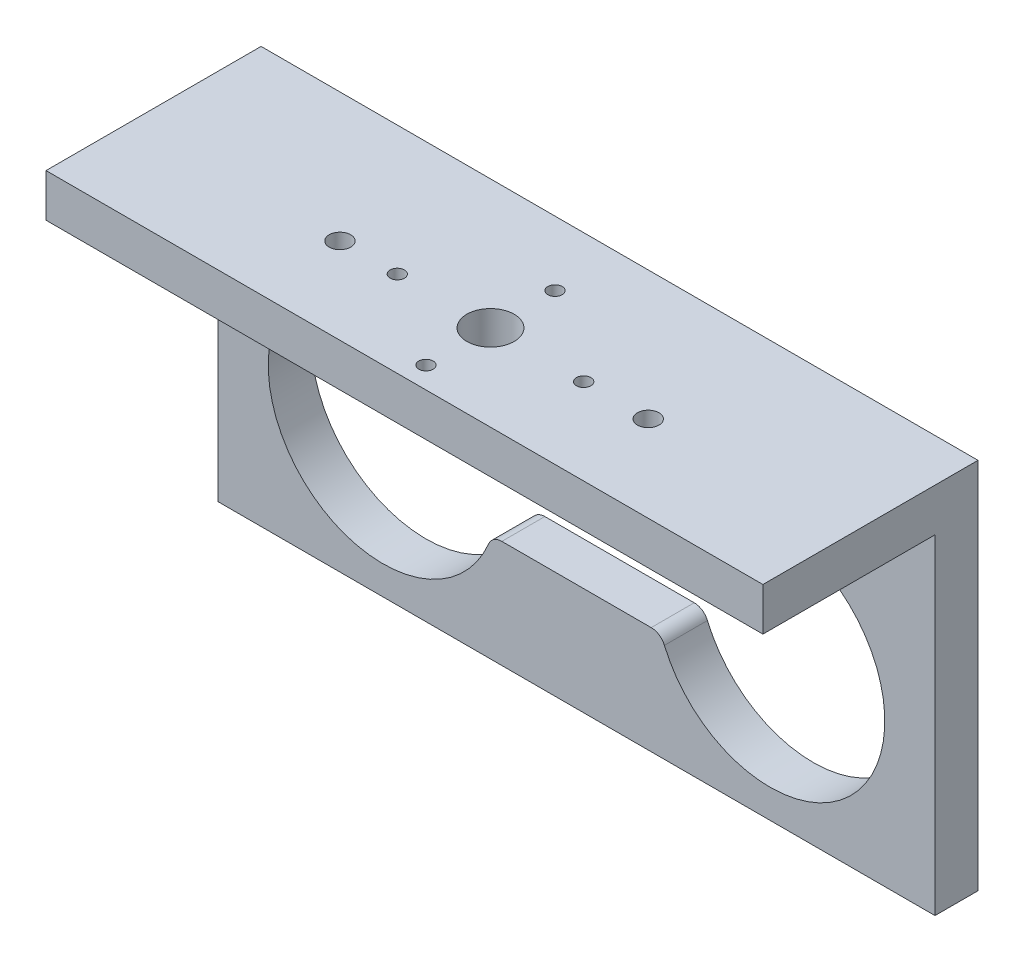
ISO-10303-21;
HEADER;
FILE_DESCRIPTION(('STEP AP214'),'2;1');
FILE_NAME('part.step','',(''),(''),'','','');
FILE_SCHEMA(('AUTOMOTIVE_DESIGN { 1 0 10303 214 1 1 1 1 }'));
ENDSEC;
DATA;
#1=APPLICATION_CONTEXT('core data for automotive mechanical design processes');
#2=APPLICATION_PROTOCOL_DEFINITION('international standard','automotive_design',2000,#1);
#3=PRODUCT_CONTEXT('',#1,'mechanical');
#4=PRODUCT('Part','Part','',(#3));
#5=PRODUCT_RELATED_PRODUCT_CATEGORY('part','',(#4));
#6=PRODUCT_DEFINITION_FORMATION('','',#4);
#7=PRODUCT_DEFINITION_CONTEXT('part definition',#1,'design');
#8=PRODUCT_DEFINITION('design','',#6,#7);
#9=PRODUCT_DEFINITION_SHAPE('','',#8);
#10=(LENGTH_UNIT() NAMED_UNIT(*) SI_UNIT(.MILLI.,.METRE.));
#11=(NAMED_UNIT(*) PLANE_ANGLE_UNIT() SI_UNIT($,.RADIAN.));
#12=(NAMED_UNIT(*) SI_UNIT($,.STERADIAN.) SOLID_ANGLE_UNIT());
#13=UNCERTAINTY_MEASURE_WITH_UNIT(LENGTH_MEASURE(1.E-05),#10,'distance_accuracy_value','');
#14=(GEOMETRIC_REPRESENTATION_CONTEXT(3) GLOBAL_UNCERTAINTY_ASSIGNED_CONTEXT((#13)) GLOBAL_UNIT_ASSIGNED_CONTEXT((#10,
#11,#12)) REPRESENTATION_CONTEXT('',''));
#15=CARTESIAN_POINT('',(0.,0.,0.));
#16=DIRECTION('',(0.,0.,1.));
#17=DIRECTION('',(1.,0.,0.));
#18=AXIS2_PLACEMENT_3D('',#15,#16,#17);
#19=CARTESIAN_POINT('',(-25.,16.,15.));
#20=DIRECTION('',(0.,0.,-1.));
#21=DIRECTION('',(-1.,0.,0.));
#22=AXIS2_PLACEMENT_3D('',#19,#20,#21);
#23=PLANE('',#22);
#24=DIRECTION('',(-1.,0.,0.));
#25=VECTOR('',#24,1.);
#26=CARTESIAN_POINT('',(25.,13.,15.));
#27=LINE('',#26,#25);
#28=CARTESIAN_POINT('',(25.,13.,15.));
#29=VERTEX_POINT('',#28);
#30=CARTESIAN_POINT('',(-25.,13.,15.));
#31=VERTEX_POINT('',#30);
#32=EDGE_CURVE('E168',#29,#31,#27,.T.);
#33=ORIENTED_EDGE('',*,*,#32,.F.);
#34=DIRECTION('',(0.,-1.,0.));
#35=VECTOR('',#34,1.);
#36=CARTESIAN_POINT('',(25.,16.,15.));
#37=LINE('',#36,#35);
#38=CARTESIAN_POINT('',(25.,16.,15.));
#39=VERTEX_POINT('',#38);
#40=EDGE_CURVE('E180',#39,#29,#37,.T.);
#41=ORIENTED_EDGE('',*,*,#40,.F.);
#42=DIRECTION('',(1.,0.,0.));
#43=VECTOR('',#42,1.);
#44=CARTESIAN_POINT('',(-25.,16.,15.));
#45=LINE('',#44,#43);
#46=CARTESIAN_POINT('',(-25.,16.,15.));
#47=VERTEX_POINT('',#46);
#48=EDGE_CURVE('E308',#47,#39,#45,.T.);
#49=ORIENTED_EDGE('',*,*,#48,.F.);
#50=DIRECTION('',(0.,-1.,0.));
#51=VECTOR('',#50,1.);
#52=CARTESIAN_POINT('',(-25.,16.,15.));
#53=LINE('',#52,#51);
#54=EDGE_CURVE('E183',#47,#31,#53,.T.);
#55=ORIENTED_EDGE('',*,*,#54,.T.);
#56=EDGE_LOOP('',(#33,#41,#49,#55));
#57=FACE_BOUND('',#56,.T.);
#58=ADVANCED_FACE('F37',(#57),#23,.F.);
#59=CARTESIAN_POINT('',(0.,0.,3.));
#60=DIRECTION('',(0.,0.,1.));
#61=DIRECTION('',(1.,0.,0.));
#62=AXIS2_PLACEMENT_3D('',#59,#60,#61);
#63=PLANE('',#62);
#64=DIRECTION('',(0.,-1.,0.));
#65=VECTOR('',#64,1.);
#66=CARTESIAN_POINT('',(-25.,-10.,3.));
#67=LINE('',#66,#65);
#68=CARTESIAN_POINT('',(-25.,13.,3.));
#69=VERTEX_POINT('',#68);
#70=CARTESIAN_POINT('',(-25.,-10.,3.));
#71=VERTEX_POINT('',#70);
#72=EDGE_CURVE('E281',#69,#71,#67,.T.);
#73=ORIENTED_EDGE('',*,*,#72,.T.);
#74=DIRECTION('',(1.,0.,0.));
#75=VECTOR('',#74,1.);
#76=CARTESIAN_POINT('',(25.,-10.,3.));
#77=LINE('',#76,#75);
#78=CARTESIAN_POINT('',(25.,-10.,3.));
#79=VERTEX_POINT('',#78);
#80=EDGE_CURVE('E284',#71,#79,#77,.T.);
#81=ORIENTED_EDGE('',*,*,#80,.T.);
#82=DIRECTION('',(0.,1.,0.));
#83=VECTOR('',#82,1.);
#84=CARTESIAN_POINT('',(25.,-10.,3.));
#85=LINE('',#84,#83);
#86=CARTESIAN_POINT('',(25.,13.,3.));
#87=VERTEX_POINT('',#86);
#88=EDGE_CURVE('E287',#79,#87,#85,.T.);
#89=ORIENTED_EDGE('',*,*,#88,.T.);
#90=DIRECTION('',(1.,0.,0.));
#91=VECTOR('',#90,1.);
#92=CARTESIAN_POINT('',(25.,13.,3.));
#93=LINE('',#92,#91);
#94=EDGE_CURVE('E171',#69,#87,#93,.T.);
#95=ORIENTED_EDGE('',*,*,#94,.F.);
#96=EDGE_LOOP('',(#73,#81,#89,#95));
#97=FACE_BOUND('',#96,.T.);
#98=CARTESIAN_POINT('',(13.5,0.,3.));
#99=DIRECTION('',(0.,0.,1.));
#100=DIRECTION('',(1.,0.,0.));
#101=AXIS2_PLACEMENT_3D('',#98,#99,#100);
#102=CIRCLE('',#101,8.);
#103=CARTESIAN_POINT('',(6.12972268809911,-3.11111111111111,3.));
#104=VERTEX_POINT('',#103);
#105=CARTESIAN_POINT('',(6.12972268809911,3.11111111111111,3.));
#106=VERTEX_POINT('',#105);
#107=EDGE_CURVE('E224',#104,#106,#102,.T.);
#108=ORIENTED_EDGE('',*,*,#107,.F.);
#109=CARTESIAN_POINT('',(5.2084380241115,-3.5,3.));
#110=DIRECTION('',(0.,0.,-1.));
#111=DIRECTION('',(-1.,0.,0.));
#112=AXIS2_PLACEMENT_3D('',#109,#110,#111);
#113=CIRCLE('',#112,1.);
#114=CARTESIAN_POINT('',(5.2084380241115,-2.5,3.));
#115=VERTEX_POINT('',#114);
#116=EDGE_CURVE('E222',#115,#104,#113,.T.);
#117=ORIENTED_EDGE('',*,*,#116,.F.);
#118=DIRECTION('',(1.,0.,0.));
#119=VECTOR('',#118,1.);
#120=CARTESIAN_POINT('',(5.2084380241115,-2.5,3.));
#121=LINE('',#120,#119);
#122=CARTESIAN_POINT('',(-5.2084380241115,-2.5,3.));
#123=VERTEX_POINT('',#122);
#124=EDGE_CURVE('E238',#123,#115,#121,.T.);
#125=ORIENTED_EDGE('',*,*,#124,.F.);
#126=CARTESIAN_POINT('',(-5.2084380241115,-3.5,3.));
#127=DIRECTION('',(0.,0.,-1.));
#128=DIRECTION('',(1.,0.,0.));
#129=AXIS2_PLACEMENT_3D('',#126,#127,#128);
#130=CIRCLE('',#129,1.);
#131=CARTESIAN_POINT('',(-6.12972268809911,-3.11111111111111,3.));
#132=VERTEX_POINT('',#131);
#133=EDGE_CURVE('E235',#132,#123,#130,.T.);
#134=ORIENTED_EDGE('',*,*,#133,.F.);
#135=CARTESIAN_POINT('',(-13.5,0.,3.));
#136=DIRECTION('',(0.,0.,1.));
#137=DIRECTION('',(1.,0.,0.));
#138=AXIS2_PLACEMENT_3D('',#135,#136,#137);
#139=CIRCLE('',#138,8.);
#140=CARTESIAN_POINT('',(-6.12972268809911,3.11111111111111,3.));
#141=VERTEX_POINT('',#140);
#142=EDGE_CURVE('E233',#141,#132,#139,.T.);
#143=ORIENTED_EDGE('',*,*,#142,.F.);
#144=CARTESIAN_POINT('',(-5.2084380241115,3.5,3.));
#145=DIRECTION('',(0.,0.,-1.));
#146=DIRECTION('',(-1.,0.,0.));
#147=AXIS2_PLACEMENT_3D('',#144,#145,#146);
#148=CIRCLE('',#147,1.);
#149=CARTESIAN_POINT('',(-5.2084380241115,2.5,3.));
#150=VERTEX_POINT('',#149);
#151=EDGE_CURVE('E231',#150,#141,#148,.T.);
#152=ORIENTED_EDGE('',*,*,#151,.F.);
#153=DIRECTION('',(-1.,0.,0.));
#154=VECTOR('',#153,1.);
#155=CARTESIAN_POINT('',(-5.2084380241115,2.5,3.));
#156=LINE('',#155,#154);
#157=CARTESIAN_POINT('',(5.2084380241115,2.5,3.));
#158=VERTEX_POINT('',#157);
#159=EDGE_CURVE('E229',#158,#150,#156,.T.);
#160=ORIENTED_EDGE('',*,*,#159,.F.);
#161=CARTESIAN_POINT('',(5.2084380241115,3.5,3.));
#162=DIRECTION('',(0.,0.,-1.));
#163=DIRECTION('',(1.,0.,0.));
#164=AXIS2_PLACEMENT_3D('',#161,#162,#163);
#165=CIRCLE('',#164,1.);
#166=EDGE_CURVE('E227',#106,#158,#165,.T.);
#167=ORIENTED_EDGE('',*,*,#166,.F.);
#168=EDGE_LOOP('',(#108,#117,#125,#134,#143,#152,#160,#167));
#169=FACE_BOUND('',#168,.T.);
#170=DIRECTION('',(-1.,0.,0.));
#171=VECTOR('',#170,1.);
#172=CARTESIAN_POINT('',(3.25,9.,3.));
#173=LINE('',#172,#171);
#174=CARTESIAN_POINT('',(3.25,9.,3.));
#175=VERTEX_POINT('',#174);
#176=CARTESIAN_POINT('',(-3.25,9.,3.));
#177=VERTEX_POINT('',#176);
#178=EDGE_CURVE('E198',#175,#177,#173,.T.);
#179=ORIENTED_EDGE('',*,*,#178,.F.);
#180=CARTESIAN_POINT('',(3.25,7.25,3.));
#181=DIRECTION('',(0.,0.,1.));
#182=DIRECTION('',(1.,0.,0.));
#183=AXIS2_PLACEMENT_3D('',#180,#181,#182);
#184=CIRCLE('',#183,1.75);
#185=CARTESIAN_POINT('',(3.25,5.5,3.));
#186=VERTEX_POINT('',#185);
#187=EDGE_CURVE('E196',#186,#175,#184,.T.);
#188=ORIENTED_EDGE('',*,*,#187,.F.);
#189=DIRECTION('',(1.,0.,0.));
#190=VECTOR('',#189,1.);
#191=CARTESIAN_POINT('',(3.25,5.5,3.));
#192=LINE('',#191,#190);
#193=CARTESIAN_POINT('',(-3.25,5.5,3.));
#194=VERTEX_POINT('',#193);
#195=EDGE_CURVE('E203',#194,#186,#192,.T.);
#196=ORIENTED_EDGE('',*,*,#195,.F.);
#197=CARTESIAN_POINT('',(-3.25,7.25,3.));
#198=DIRECTION('',(0.,0.,1.));
#199=DIRECTION('',(1.,0.,0.));
#200=AXIS2_PLACEMENT_3D('',#197,#198,#199);
#201=CIRCLE('',#200,1.75);
#202=EDGE_CURVE('E201',#177,#194,#201,.T.);
#203=ORIENTED_EDGE('',*,*,#202,.F.);
#204=EDGE_LOOP('',(#179,#188,#196,#203));
#205=FACE_BOUND('',#204,.T.);
#206=ADVANCED_FACE('F382',(#97,#169,#205),#63,.T.);
#207=CARTESIAN_POINT('',(0.,0.,0.));
#208=DIRECTION('',(0.,0.,1.));
#209=DIRECTION('',(1.,0.,0.));
#210=AXIS2_PLACEMENT_3D('',#207,#208,#209);
#211=PLANE('',#210);
#212=CARTESIAN_POINT('',(5.2084380241115,-3.5,0.));
#213=DIRECTION('',(0.,0.,-1.));
#214=DIRECTION('',(-1.,0.,0.));
#215=AXIS2_PLACEMENT_3D('',#212,#213,#214);
#216=CIRCLE('',#215,1.);
#217=CARTESIAN_POINT('',(5.2084380241115,-2.5,0.));
#218=VERTEX_POINT('',#217);
#219=CARTESIAN_POINT('',(6.12972268809911,-3.11111111111111,0.));
#220=VERTEX_POINT('',#219);
#221=EDGE_CURVE('E221',#218,#220,#216,.T.);
#222=ORIENTED_EDGE('',*,*,#221,.T.);
#223=CARTESIAN_POINT('',(13.5,0.,0.));
#224=DIRECTION('',(0.,0.,1.));
#225=DIRECTION('',(1.,0.,0.));
#226=AXIS2_PLACEMENT_3D('',#223,#224,#225);
#227=CIRCLE('',#226,8.);
#228=CARTESIAN_POINT('',(6.12972268809911,3.11111111111111,0.));
#229=VERTEX_POINT('',#228);
#230=EDGE_CURVE('E243',#220,#229,#227,.T.);
#231=ORIENTED_EDGE('',*,*,#230,.T.);
#232=CARTESIAN_POINT('',(5.2084380241115,3.5,0.));
#233=DIRECTION('',(0.,0.,-1.));
#234=DIRECTION('',(1.,0.,0.));
#235=AXIS2_PLACEMENT_3D('',#232,#233,#234);
#236=CIRCLE('',#235,1.);
#237=CARTESIAN_POINT('',(5.2084380241115,2.5,0.));
#238=VERTEX_POINT('',#237);
#239=EDGE_CURVE('E246',#229,#238,#236,.T.);
#240=ORIENTED_EDGE('',*,*,#239,.T.);
#241=DIRECTION('',(-1.,0.,0.));
#242=VECTOR('',#241,1.);
#243=CARTESIAN_POINT('',(-5.2084380241115,2.5,0.));
#244=LINE('',#243,#242);
#245=CARTESIAN_POINT('',(-5.2084380241115,2.5,0.));
#246=VERTEX_POINT('',#245);
#247=EDGE_CURVE('E249',#238,#246,#244,.T.);
#248=ORIENTED_EDGE('',*,*,#247,.T.);
#249=CARTESIAN_POINT('',(-5.2084380241115,3.5,0.));
#250=DIRECTION('',(0.,0.,-1.));
#251=DIRECTION('',(-1.,0.,0.));
#252=AXIS2_PLACEMENT_3D('',#249,#250,#251);
#253=CIRCLE('',#252,1.);
#254=CARTESIAN_POINT('',(-6.12972268809911,3.11111111111111,0.));
#255=VERTEX_POINT('',#254);
#256=EDGE_CURVE('E252',#246,#255,#253,.T.);
#257=ORIENTED_EDGE('',*,*,#256,.T.);
#258=CARTESIAN_POINT('',(-13.5,0.,0.));
#259=DIRECTION('',(0.,0.,1.));
#260=DIRECTION('',(1.,0.,0.));
#261=AXIS2_PLACEMENT_3D('',#258,#259,#260);
#262=CIRCLE('',#261,8.);
#263=CARTESIAN_POINT('',(-6.12972268809911,-3.11111111111111,0.));
#264=VERTEX_POINT('',#263);
#265=EDGE_CURVE('E255',#255,#264,#262,.T.);
#266=ORIENTED_EDGE('',*,*,#265,.T.);
#267=CARTESIAN_POINT('',(-5.2084380241115,-3.5,0.));
#268=DIRECTION('',(0.,0.,-1.));
#269=DIRECTION('',(1.,0.,0.));
#270=AXIS2_PLACEMENT_3D('',#267,#268,#269);
#271=CIRCLE('',#270,1.);
#272=CARTESIAN_POINT('',(-5.2084380241115,-2.5,0.));
#273=VERTEX_POINT('',#272);
#274=EDGE_CURVE('E258',#264,#273,#271,.T.);
#275=ORIENTED_EDGE('',*,*,#274,.T.);
#276=DIRECTION('',(1.,0.,0.));
#277=VECTOR('',#276,1.);
#278=CARTESIAN_POINT('',(5.2084380241115,-2.5,0.));
#279=LINE('',#278,#277);
#280=EDGE_CURVE('E225',#273,#218,#279,.T.);
#281=ORIENTED_EDGE('',*,*,#280,.T.);
#282=EDGE_LOOP('',(#222,#231,#240,#248,#257,#266,#275,#281));
#283=FACE_BOUND('',#282,.T.);
#284=DIRECTION('',(0.,-1.,0.));
#285=VECTOR('',#284,1.);
#286=CARTESIAN_POINT('',(-25.,-10.,0.));
#287=LINE('',#286,#285);
#288=CARTESIAN_POINT('',(-25.,16.,0.));
#289=VERTEX_POINT('',#288);
#290=CARTESIAN_POINT('',(-25.,-10.,0.));
#291=VERTEX_POINT('',#290);
#292=EDGE_CURVE('E280',#289,#291,#287,.T.);
#293=ORIENTED_EDGE('',*,*,#292,.F.);
#294=DIRECTION('',(-1.,0.,0.));
#295=VECTOR('',#294,1.);
#296=CARTESIAN_POINT('',(-25.,16.,0.));
#297=LINE('',#296,#295);
#298=CARTESIAN_POINT('',(25.,16.,0.));
#299=VERTEX_POINT('',#298);
#300=EDGE_CURVE('E189',#299,#289,#297,.T.);
#301=ORIENTED_EDGE('',*,*,#300,.F.);
#302=DIRECTION('',(0.,1.,0.));
#303=VECTOR('',#302,1.);
#304=CARTESIAN_POINT('',(25.,-10.,0.));
#305=LINE('',#304,#303);
#306=CARTESIAN_POINT('',(25.,-10.,0.));
#307=VERTEX_POINT('',#306);
#308=EDGE_CURVE('E285',#307,#299,#305,.T.);
#309=ORIENTED_EDGE('',*,*,#308,.F.);
#310=DIRECTION('',(1.,0.,0.));
#311=VECTOR('',#310,1.);
#312=CARTESIAN_POINT('',(25.,-10.,0.));
#313=LINE('',#312,#311);
#314=EDGE_CURVE('E291',#291,#307,#313,.T.);
#315=ORIENTED_EDGE('',*,*,#314,.F.);
#316=EDGE_LOOP('',(#293,#301,#309,#315));
#317=FACE_BOUND('',#316,.T.);
#318=CARTESIAN_POINT('',(3.25,7.25,0.));
#319=DIRECTION('',(0.,0.,1.));
#320=DIRECTION('',(1.,0.,0.));
#321=AXIS2_PLACEMENT_3D('',#318,#319,#320);
#322=CIRCLE('',#321,1.75);
#323=CARTESIAN_POINT('',(3.25,5.5,0.));
#324=VERTEX_POINT('',#323);
#325=CARTESIAN_POINT('',(3.25,9.,0.));
#326=VERTEX_POINT('',#325);
#327=EDGE_CURVE('E60',#324,#326,#322,.T.);
#328=ORIENTED_EDGE('',*,*,#327,.T.);
#329=DIRECTION('',(-1.,0.,0.));
#330=VECTOR('',#329,1.);
#331=CARTESIAN_POINT('',(3.25,9.,0.));
#332=LINE('',#331,#330);
#333=CARTESIAN_POINT('',(-3.25,9.,0.));
#334=VERTEX_POINT('',#333);
#335=EDGE_CURVE('E207',#326,#334,#332,.T.);
#336=ORIENTED_EDGE('',*,*,#335,.T.);
#337=CARTESIAN_POINT('',(-3.25,7.25,0.));
#338=DIRECTION('',(0.,0.,1.));
#339=DIRECTION('',(1.,0.,0.));
#340=AXIS2_PLACEMENT_3D('',#337,#338,#339);
#341=CIRCLE('',#340,1.75);
#342=CARTESIAN_POINT('',(-3.25,5.5,0.));
#343=VERTEX_POINT('',#342);
#344=EDGE_CURVE('E210',#334,#343,#341,.T.);
#345=ORIENTED_EDGE('',*,*,#344,.T.);
#346=DIRECTION('',(1.,0.,0.));
#347=VECTOR('',#346,1.);
#348=CARTESIAN_POINT('',(3.25,5.5,0.));
#349=LINE('',#348,#347);
#350=EDGE_CURVE('E199',#343,#324,#349,.T.);
#351=ORIENTED_EDGE('',*,*,#350,.T.);
#352=EDGE_LOOP('',(#328,#336,#345,#351));
#353=FACE_BOUND('',#352,.T.);
#354=ADVANCED_FACE('F299',(#283,#317,#353),#211,.F.);
#355=CARTESIAN_POINT('',(-25.,-10.,3.));
#356=DIRECTION('',(1.,0.,0.));
#357=DIRECTION('',(0.,0.,-1.));
#358=AXIS2_PLACEMENT_3D('',#355,#356,#357);
#359=PLANE('',#358);
#360=ORIENTED_EDGE('',*,*,#72,.F.);
#361=DIRECTION('',(0.,0.,-1.));
#362=VECTOR('',#361,1.);
#363=CARTESIAN_POINT('',(-25.,13.,3.));
#364=LINE('',#363,#362);
#365=EDGE_CURVE('E184',#31,#69,#364,.T.);
#366=ORIENTED_EDGE('',*,*,#365,.F.);
#367=ORIENTED_EDGE('',*,*,#54,.F.);
#368=DIRECTION('',(0.,0.,1.));
#369=VECTOR('',#368,1.);
#370=CARTESIAN_POINT('',(-25.,16.,0.));
#371=LINE('',#370,#369);
#372=EDGE_CURVE('E305',#289,#47,#371,.T.);
#373=ORIENTED_EDGE('',*,*,#372,.F.);
#374=ORIENTED_EDGE('',*,*,#292,.T.);
#375=DIRECTION('',(0.,0.,-1.));
#376=VECTOR('',#375,1.);
#377=CARTESIAN_POINT('',(-25.,-10.,3.));
#378=LINE('',#377,#376);
#379=EDGE_CURVE('E11',#71,#291,#378,.T.);
#380=ORIENTED_EDGE('',*,*,#379,.F.);
#381=EDGE_LOOP('',(#360,#366,#367,#373,#374,#380));
#382=FACE_BOUND('',#381,.T.);
#383=ADVANCED_FACE('F39',(#382),#359,.F.);
#384=CARTESIAN_POINT('',(25.,-10.,3.));
#385=DIRECTION('',(0.,1.,0.));
#386=DIRECTION('',(-1.,0.,0.));
#387=AXIS2_PLACEMENT_3D('',#384,#385,#386);
#388=PLANE('',#387);
#389=ORIENTED_EDGE('',*,*,#314,.T.);
#390=DIRECTION('',(0.,0.,-1.));
#391=VECTOR('',#390,1.);
#392=CARTESIAN_POINT('',(25.,-10.,3.));
#393=LINE('',#392,#391);
#394=EDGE_CURVE('E45',#79,#307,#393,.T.);
#395=ORIENTED_EDGE('',*,*,#394,.F.);
#396=ORIENTED_EDGE('',*,*,#80,.F.);
#397=ORIENTED_EDGE('',*,*,#379,.T.);
#398=EDGE_LOOP('',(#389,#395,#396,#397));
#399=FACE_BOUND('',#398,.T.);
#400=ADVANCED_FACE('F439',(#399),#388,.F.);
#401=CARTESIAN_POINT('',(25.,-10.,3.));
#402=DIRECTION('',(-1.,0.,0.));
#403=DIRECTION('',(0.,0.,1.));
#404=AXIS2_PLACEMENT_3D('',#401,#402,#403);
#405=PLANE('',#404);
#406=DIRECTION('',(0.,0.,1.));
#407=VECTOR('',#406,1.);
#408=CARTESIAN_POINT('',(25.,13.,3.));
#409=LINE('',#408,#407);
#410=EDGE_CURVE('E164',#87,#29,#409,.T.);
#411=ORIENTED_EDGE('',*,*,#410,.F.);
#412=ORIENTED_EDGE('',*,*,#88,.F.);
#413=ORIENTED_EDGE('',*,*,#394,.T.);
#414=ORIENTED_EDGE('',*,*,#308,.T.);
#415=DIRECTION('',(0.,0.,-1.));
#416=VECTOR('',#415,1.);
#417=CARTESIAN_POINT('',(25.,16.,0.));
#418=LINE('',#417,#416);
#419=EDGE_CURVE('E188',#39,#299,#418,.T.);
#420=ORIENTED_EDGE('',*,*,#419,.F.);
#421=ORIENTED_EDGE('',*,*,#40,.T.);
#422=EDGE_LOOP('',(#411,#412,#413,#414,#420,#421));
#423=FACE_BOUND('',#422,.T.);
#424=ADVANCED_FACE('F186',(#423),#405,.F.);
#425=CARTESIAN_POINT('',(5.2084380241115,-3.5,3.));
#426=DIRECTION('',(0.,0.,-1.));
#427=DIRECTION('',(-1.,0.,0.));
#428=AXIS2_PLACEMENT_3D('',#425,#426,#427);
#429=CYLINDRICAL_SURFACE('',#428,1.);
#430=ORIENTED_EDGE('',*,*,#221,.F.);
#431=DIRECTION('',(0.,0.,-1.));
#432=VECTOR('',#431,1.);
#433=CARTESIAN_POINT('',(5.2084380241115,-2.5,3.));
#434=LINE('',#433,#432);
#435=EDGE_CURVE('E240',#115,#218,#434,.T.);
#436=ORIENTED_EDGE('',*,*,#435,.F.);
#437=ORIENTED_EDGE('',*,*,#116,.T.);
#438=DIRECTION('',(0.,0.,-1.));
#439=VECTOR('',#438,1.);
#440=CARTESIAN_POINT('',(6.12972268809911,-3.11111111111111,3.));
#441=LINE('',#440,#439);
#442=EDGE_CURVE('E277',#104,#220,#441,.T.);
#443=ORIENTED_EDGE('',*,*,#442,.T.);
#444=EDGE_LOOP('',(#430,#436,#437,#443));
#445=FACE_BOUND('',#444,.T.);
#446=ADVANCED_FACE('F430',(#445),#429,.T.);
#447=CARTESIAN_POINT('',(13.5,0.,3.));
#448=DIRECTION('',(0.,0.,-1.));
#449=DIRECTION('',(-1.,0.,0.));
#450=AXIS2_PLACEMENT_3D('',#447,#448,#449);
#451=CYLINDRICAL_SURFACE('',#450,8.);
#452=ORIENTED_EDGE('',*,*,#230,.F.);
#453=ORIENTED_EDGE('',*,*,#442,.F.);
#454=ORIENTED_EDGE('',*,*,#107,.T.);
#455=DIRECTION('',(0.,0.,-1.));
#456=VECTOR('',#455,1.);
#457=CARTESIAN_POINT('',(6.12972268809911,3.11111111111111,3.));
#458=LINE('',#457,#456);
#459=EDGE_CURVE('E275',#106,#229,#458,.T.);
#460=ORIENTED_EDGE('',*,*,#459,.T.);
#461=EDGE_LOOP('',(#452,#453,#454,#460));
#462=FACE_BOUND('',#461,.T.);
#463=ADVANCED_FACE('F426',(#462),#451,.F.);
#464=CARTESIAN_POINT('',(5.2084380241115,3.5,3.));
#465=DIRECTION('',(0.,0.,-1.));
#466=DIRECTION('',(-1.,0.,0.));
#467=AXIS2_PLACEMENT_3D('',#464,#465,#466);
#468=CYLINDRICAL_SURFACE('',#467,1.);
#469=ORIENTED_EDGE('',*,*,#239,.F.);
#470=ORIENTED_EDGE('',*,*,#459,.F.);
#471=ORIENTED_EDGE('',*,*,#166,.T.);
#472=DIRECTION('',(0.,0.,-1.));
#473=VECTOR('',#472,1.);
#474=CARTESIAN_POINT('',(5.2084380241115,2.5,3.));
#475=LINE('',#474,#473);
#476=EDGE_CURVE('E273',#158,#238,#475,.T.);
#477=ORIENTED_EDGE('',*,*,#476,.T.);
#478=EDGE_LOOP('',(#469,#470,#471,#477));
#479=FACE_BOUND('',#478,.T.);
#480=ADVANCED_FACE('F422',(#479),#468,.T.);
#481=CARTESIAN_POINT('',(-5.2084380241115,2.5,3.));
#482=DIRECTION('',(0.,-1.,0.));
#483=DIRECTION('',(0.,0.,-1.));
#484=AXIS2_PLACEMENT_3D('',#481,#482,#483);
#485=PLANE('',#484);
#486=ORIENTED_EDGE('',*,*,#247,.F.);
#487=ORIENTED_EDGE('',*,*,#476,.F.);
#488=ORIENTED_EDGE('',*,*,#159,.T.);
#489=DIRECTION('',(0.,0.,-1.));
#490=VECTOR('',#489,1.);
#491=CARTESIAN_POINT('',(-5.2084380241115,2.5,3.));
#492=LINE('',#491,#490);
#493=EDGE_CURVE('E271',#150,#246,#492,.T.);
#494=ORIENTED_EDGE('',*,*,#493,.T.);
#495=EDGE_LOOP('',(#486,#487,#488,#494));
#496=FACE_BOUND('',#495,.T.);
#497=ADVANCED_FACE('F418',(#496),#485,.T.);
#498=CARTESIAN_POINT('',(-5.2084380241115,3.5,3.));
#499=DIRECTION('',(0.,0.,-1.));
#500=DIRECTION('',(-1.,0.,0.));
#501=AXIS2_PLACEMENT_3D('',#498,#499,#500);
#502=CYLINDRICAL_SURFACE('',#501,1.);
#503=ORIENTED_EDGE('',*,*,#256,.F.);
#504=ORIENTED_EDGE('',*,*,#493,.F.);
#505=ORIENTED_EDGE('',*,*,#151,.T.);
#506=DIRECTION('',(0.,0.,-1.));
#507=VECTOR('',#506,1.);
#508=CARTESIAN_POINT('',(-6.12972268809911,3.11111111111111,3.));
#509=LINE('',#508,#507);
#510=EDGE_CURVE('E269',#141,#255,#509,.T.);
#511=ORIENTED_EDGE('',*,*,#510,.T.);
#512=EDGE_LOOP('',(#503,#504,#505,#511));
#513=FACE_BOUND('',#512,.T.);
#514=ADVANCED_FACE('F414',(#513),#502,.T.);
#515=CARTESIAN_POINT('',(-13.5,0.,3.));
#516=DIRECTION('',(0.,0.,-1.));
#517=DIRECTION('',(-1.,0.,0.));
#518=AXIS2_PLACEMENT_3D('',#515,#516,#517);
#519=CYLINDRICAL_SURFACE('',#518,8.);
#520=ORIENTED_EDGE('',*,*,#265,.F.);
#521=ORIENTED_EDGE('',*,*,#510,.F.);
#522=ORIENTED_EDGE('',*,*,#142,.T.);
#523=DIRECTION('',(0.,0.,-1.));
#524=VECTOR('',#523,1.);
#525=CARTESIAN_POINT('',(-6.12972268809911,-3.11111111111111,3.));
#526=LINE('',#525,#524);
#527=EDGE_CURVE('E267',#132,#264,#526,.T.);
#528=ORIENTED_EDGE('',*,*,#527,.T.);
#529=EDGE_LOOP('',(#520,#521,#522,#528));
#530=FACE_BOUND('',#529,.T.);
#531=ADVANCED_FACE('F410',(#530),#519,.F.);
#532=CARTESIAN_POINT('',(-5.2084380241115,-3.5,3.));
#533=DIRECTION('',(0.,0.,-1.));
#534=DIRECTION('',(-1.,0.,0.));
#535=AXIS2_PLACEMENT_3D('',#532,#533,#534);
#536=CYLINDRICAL_SURFACE('',#535,1.);
#537=ORIENTED_EDGE('',*,*,#274,.F.);
#538=ORIENTED_EDGE('',*,*,#527,.F.);
#539=ORIENTED_EDGE('',*,*,#133,.T.);
#540=DIRECTION('',(0.,0.,-1.));
#541=VECTOR('',#540,1.);
#542=CARTESIAN_POINT('',(-5.2084380241115,-2.5,3.));
#543=LINE('',#542,#541);
#544=EDGE_CURVE('E265',#123,#273,#543,.T.);
#545=ORIENTED_EDGE('',*,*,#544,.T.);
#546=EDGE_LOOP('',(#537,#538,#539,#545));
#547=FACE_BOUND('',#546,.T.);
#548=ADVANCED_FACE('F406',(#547),#536,.T.);
#549=CARTESIAN_POINT('',(5.2084380241115,-2.5,3.));
#550=DIRECTION('',(0.,1.,0.));
#551=DIRECTION('',(-1.,0.,0.));
#552=AXIS2_PLACEMENT_3D('',#549,#550,#551);
#553=PLANE('',#552);
#554=ORIENTED_EDGE('',*,*,#280,.F.);
#555=ORIENTED_EDGE('',*,*,#544,.F.);
#556=ORIENTED_EDGE('',*,*,#124,.T.);
#557=ORIENTED_EDGE('',*,*,#435,.T.);
#558=EDGE_LOOP('',(#554,#555,#556,#557));
#559=FACE_BOUND('',#558,.T.);
#560=ADVANCED_FACE('F403',(#559),#553,.T.);
#561=CARTESIAN_POINT('',(3.25,7.25,3.));
#562=DIRECTION('',(0.,0.,-1.));
#563=DIRECTION('',(-1.,0.,0.));
#564=AXIS2_PLACEMENT_3D('',#561,#562,#563);
#565=CYLINDRICAL_SURFACE('',#564,1.75);
#566=ORIENTED_EDGE('',*,*,#327,.F.);
#567=DIRECTION('',(0.,0.,-1.));
#568=VECTOR('',#567,1.);
#569=CARTESIAN_POINT('',(3.25,5.5,3.));
#570=LINE('',#569,#568);
#571=EDGE_CURVE('E205',#186,#324,#570,.T.);
#572=ORIENTED_EDGE('',*,*,#571,.F.);
#573=ORIENTED_EDGE('',*,*,#187,.T.);
#574=DIRECTION('',(0.,0.,-1.));
#575=VECTOR('',#574,1.);
#576=CARTESIAN_POINT('',(3.25,9.,3.));
#577=LINE('',#576,#575);
#578=EDGE_CURVE('E219',#175,#326,#577,.T.);
#579=ORIENTED_EDGE('',*,*,#578,.T.);
#580=EDGE_LOOP('',(#566,#572,#573,#579));
#581=FACE_BOUND('',#580,.T.);
#582=ADVANCED_FACE('F399',(#581),#565,.F.);
#583=CARTESIAN_POINT('',(3.25,9.,3.));
#584=DIRECTION('',(0.,-1.,0.));
#585=DIRECTION('',(1.,0.,0.));
#586=AXIS2_PLACEMENT_3D('',#583,#584,#585);
#587=PLANE('',#586);
#588=ORIENTED_EDGE('',*,*,#335,.F.);
#589=ORIENTED_EDGE('',*,*,#578,.F.);
#590=ORIENTED_EDGE('',*,*,#178,.T.);
#591=DIRECTION('',(0.,0.,-1.));
#592=VECTOR('',#591,1.);
#593=CARTESIAN_POINT('',(-3.25,9.,3.));
#594=LINE('',#593,#592);
#595=EDGE_CURVE('E217',#177,#334,#594,.T.);
#596=ORIENTED_EDGE('',*,*,#595,.T.);
#597=EDGE_LOOP('',(#588,#589,#590,#596));
#598=FACE_BOUND('',#597,.T.);
#599=ADVANCED_FACE('F395',(#598),#587,.T.);
#600=CARTESIAN_POINT('',(-3.25,7.25,3.));
#601=DIRECTION('',(0.,0.,-1.));
#602=DIRECTION('',(-1.,0.,0.));
#603=AXIS2_PLACEMENT_3D('',#600,#601,#602);
#604=CYLINDRICAL_SURFACE('',#603,1.75);
#605=ORIENTED_EDGE('',*,*,#344,.F.);
#606=ORIENTED_EDGE('',*,*,#595,.F.);
#607=ORIENTED_EDGE('',*,*,#202,.T.);
#608=DIRECTION('',(0.,0.,-1.));
#609=VECTOR('',#608,1.);
#610=CARTESIAN_POINT('',(-3.25,5.5,3.));
#611=LINE('',#610,#609);
#612=EDGE_CURVE('E52',#194,#343,#611,.T.);
#613=ORIENTED_EDGE('',*,*,#612,.T.);
#614=EDGE_LOOP('',(#605,#606,#607,#613));
#615=FACE_BOUND('',#614,.T.);
#616=ADVANCED_FACE('F392',(#615),#604,.F.);
#617=CARTESIAN_POINT('',(3.25,5.5,3.));
#618=DIRECTION('',(0.,1.,0.));
#619=DIRECTION('',(0.,0.,1.));
#620=AXIS2_PLACEMENT_3D('',#617,#618,#619);
#621=PLANE('',#620);
#622=ORIENTED_EDGE('',*,*,#350,.F.);
#623=ORIENTED_EDGE('',*,*,#612,.F.);
#624=ORIENTED_EDGE('',*,*,#195,.T.);
#625=ORIENTED_EDGE('',*,*,#571,.T.);
#626=EDGE_LOOP('',(#622,#623,#624,#625));
#627=FACE_BOUND('',#626,.T.);
#628=ADVANCED_FACE('F361',(#627),#621,.T.);
#629=CARTESIAN_POINT('',(0.,16.,0.));
#630=DIRECTION('',(0.,1.,0.));
#631=DIRECTION('',(-1.,0.,0.));
#632=AXIS2_PLACEMENT_3D('',#629,#630,#631);
#633=PLANE('',#632);
#634=CARTESIAN_POINT('',(-10.5,16.,9.));
#635=DIRECTION('',(0.,1.,0.));
#636=DIRECTION('',(-1.,0.,0.));
#637=AXIS2_PLACEMENT_3D('',#634,#635,#636);
#638=CIRCLE('',#637,0.75);
#639=CARTESIAN_POINT('',(-11.25,16.,9.));
#640=VERTEX_POINT('',#639);
#641=EDGE_CURVE('E336',#640,#640,#638,.T.);
#642=ORIENTED_EDGE('',*,*,#641,.F.);
#643=EDGE_LOOP('',(#642));
#644=FACE_BOUND('',#643,.T.);
#645=CARTESIAN_POINT('',(11.,16.,9.));
#646=DIRECTION('',(0.,1.,0.));
#647=DIRECTION('',(-1.,0.,0.));
#648=AXIS2_PLACEMENT_3D('',#645,#646,#647);
#649=CIRCLE('',#648,0.75);
#650=CARTESIAN_POINT('',(10.25,16.,9.));
#651=VERTEX_POINT('',#650);
#652=EDGE_CURVE('E335',#651,#651,#649,.T.);
#653=ORIENTED_EDGE('',*,*,#652,.F.);
#654=EDGE_LOOP('',(#653));
#655=FACE_BOUND('',#654,.T.);
#656=CARTESIAN_POINT('',(-6.5,16.,9.));
#657=DIRECTION('',(0.,1.,0.));
#658=DIRECTION('',(-1.,0.,0.));
#659=AXIS2_PLACEMENT_3D('',#656,#657,#658);
#660=CIRCLE('',#659,0.500000000000002);
#661=CARTESIAN_POINT('',(-7.,16.,9.));
#662=VERTEX_POINT('',#661);
#663=EDGE_CURVE('E324',#662,#662,#660,.T.);
#664=ORIENTED_EDGE('',*,*,#663,.F.);
#665=EDGE_LOOP('',(#664));
#666=FACE_BOUND('',#665,.T.);
#667=CARTESIAN_POINT('',(6.5,16.,9.));
#668=DIRECTION('',(0.,1.,0.));
#669=DIRECTION('',(-1.,0.,0.));
#670=AXIS2_PLACEMENT_3D('',#667,#668,#669);
#671=CIRCLE('',#670,0.500000000000002);
#672=CARTESIAN_POINT('',(6.,16.,9.));
#673=VERTEX_POINT('',#672);
#674=EDGE_CURVE('E323',#673,#673,#671,.T.);
#675=ORIENTED_EDGE('',*,*,#674,.F.);
#676=EDGE_LOOP('',(#675));
#677=FACE_BOUND('',#676,.T.);
#678=CARTESIAN_POINT('',(0.,16.,4.5));
#679=DIRECTION('',(0.,1.,0.));
#680=DIRECTION('',(-1.,0.,0.));
#681=AXIS2_PLACEMENT_3D('',#678,#679,#680);
#682=CIRCLE('',#681,0.5);
#683=CARTESIAN_POINT('',(-0.500000000000003,16.,4.5));
#684=VERTEX_POINT('',#683);
#685=EDGE_CURVE('E347',#684,#684,#682,.T.);
#686=ORIENTED_EDGE('',*,*,#685,.F.);
#687=EDGE_LOOP('',(#686));
#688=FACE_BOUND('',#687,.T.);
#689=CARTESIAN_POINT('',(0.,16.,13.5));
#690=DIRECTION('',(0.,1.,0.));
#691=DIRECTION('',(-1.,0.,0.));
#692=AXIS2_PLACEMENT_3D('',#689,#690,#691);
#693=CIRCLE('',#692,0.5);
#694=CARTESIAN_POINT('',(-0.500000000000003,16.,13.5));
#695=VERTEX_POINT('',#694);
#696=EDGE_CURVE('E348',#695,#695,#693,.T.);
#697=ORIENTED_EDGE('',*,*,#696,.F.);
#698=EDGE_LOOP('',(#697));
#699=FACE_BOUND('',#698,.T.);
#700=CARTESIAN_POINT('',(0.,16.,9.));
#701=DIRECTION('',(0.,1.,0.));
#702=DIRECTION('',(-1.,0.,0.));
#703=AXIS2_PLACEMENT_3D('',#700,#701,#702);
#704=CIRCLE('',#703,1.65);
#705=CARTESIAN_POINT('',(-1.65,16.,9.));
#706=VERTEX_POINT('',#705);
#707=EDGE_CURVE('E316',#706,#706,#704,.T.);
#708=ORIENTED_EDGE('',*,*,#707,.F.);
#709=EDGE_LOOP('',(#708));
#710=FACE_BOUND('',#709,.T.);
#711=ORIENTED_EDGE('',*,*,#372,.T.);
#712=ORIENTED_EDGE('',*,*,#48,.T.);
#713=ORIENTED_EDGE('',*,*,#419,.T.);
#714=ORIENTED_EDGE('',*,*,#300,.T.);
#715=EDGE_LOOP('',(#711,#712,#713,#714));
#716=FACE_BOUND('',#715,.T.);
#717=ADVANCED_FACE('F304',(#644,#655,#666,#677,#688,#699,#710,#716),#633,.T.);
#718=CARTESIAN_POINT('',(0.,13.,0.));
#719=DIRECTION('',(0.,-1.,0.));
#720=DIRECTION('',(1.,0.,0.));
#721=AXIS2_PLACEMENT_3D('',#718,#719,#720);
#722=PLANE('',#721);
#723=CARTESIAN_POINT('',(-10.5,13.,9.));
#724=DIRECTION('',(0.,-1.,0.));
#725=DIRECTION('',(1.,0.,0.));
#726=AXIS2_PLACEMENT_3D('',#723,#724,#725);
#727=CIRCLE('',#726,0.75);
#728=CARTESIAN_POINT('',(-9.75,13.,9.));
#729=VERTEX_POINT('',#728);
#730=EDGE_CURVE('E332',#729,#729,#727,.F.);
#731=ORIENTED_EDGE('',*,*,#730,.T.);
#732=EDGE_LOOP('',(#731));
#733=FACE_BOUND('',#732,.T.);
#734=CARTESIAN_POINT('',(11.,13.,9.));
#735=DIRECTION('',(0.,-1.,0.));
#736=DIRECTION('',(1.,0.,0.));
#737=AXIS2_PLACEMENT_3D('',#734,#735,#736);
#738=CIRCLE('',#737,0.75);
#739=CARTESIAN_POINT('',(11.75,13.,9.));
#740=VERTEX_POINT('',#739);
#741=EDGE_CURVE('E327',#740,#740,#738,.F.);
#742=ORIENTED_EDGE('',*,*,#741,.T.);
#743=EDGE_LOOP('',(#742));
#744=FACE_BOUND('',#743,.T.);
#745=CARTESIAN_POINT('',(-6.5,13.,9.));
#746=DIRECTION('',(0.,-1.,0.));
#747=DIRECTION('',(1.,0.,0.));
#748=AXIS2_PLACEMENT_3D('',#745,#746,#747);
#749=CIRCLE('',#748,0.500000000000002);
#750=CARTESIAN_POINT('',(-6.,13.,9.));
#751=VERTEX_POINT('',#750);
#752=EDGE_CURVE('E320',#751,#751,#749,.F.);
#753=ORIENTED_EDGE('',*,*,#752,.T.);
#754=EDGE_LOOP('',(#753));
#755=FACE_BOUND('',#754,.T.);
#756=CARTESIAN_POINT('',(6.5,13.,9.));
#757=DIRECTION('',(0.,-1.,0.));
#758=DIRECTION('',(1.,0.,0.));
#759=AXIS2_PLACEMENT_3D('',#756,#757,#758);
#760=CIRCLE('',#759,0.500000000000002);
#761=CARTESIAN_POINT('',(7.,13.,9.));
#762=VERTEX_POINT('',#761);
#763=EDGE_CURVE('E319',#762,#762,#760,.F.);
#764=ORIENTED_EDGE('',*,*,#763,.T.);
#765=EDGE_LOOP('',(#764));
#766=FACE_BOUND('',#765,.T.);
#767=CARTESIAN_POINT('',(0.,13.,4.5));
#768=DIRECTION('',(0.,-1.,0.));
#769=DIRECTION('',(1.,0.,0.));
#770=AXIS2_PLACEMENT_3D('',#767,#768,#769);
#771=CIRCLE('',#770,0.5);
#772=CARTESIAN_POINT('',(0.499999999999999,13.,4.5));
#773=VERTEX_POINT('',#772);
#774=EDGE_CURVE('E339',#773,#773,#771,.F.);
#775=ORIENTED_EDGE('',*,*,#774,.T.);
#776=EDGE_LOOP('',(#775));
#777=FACE_BOUND('',#776,.T.);
#778=CARTESIAN_POINT('',(0.,13.,13.5));
#779=DIRECTION('',(0.,-1.,0.));
#780=DIRECTION('',(1.,0.,0.));
#781=AXIS2_PLACEMENT_3D('',#778,#779,#780);
#782=CIRCLE('',#781,0.5);
#783=CARTESIAN_POINT('',(0.499999999999999,13.,13.5));
#784=VERTEX_POINT('',#783);
#785=EDGE_CURVE('E344',#784,#784,#782,.F.);
#786=ORIENTED_EDGE('',*,*,#785,.T.);
#787=EDGE_LOOP('',(#786));
#788=FACE_BOUND('',#787,.T.);
#789=CARTESIAN_POINT('',(0.,13.,9.));
#790=DIRECTION('',(0.,-1.,0.));
#791=DIRECTION('',(1.,0.,0.));
#792=AXIS2_PLACEMENT_3D('',#789,#790,#791);
#793=CIRCLE('',#792,1.65);
#794=CARTESIAN_POINT('',(1.65,13.,9.));
#795=VERTEX_POINT('',#794);
#796=EDGE_CURVE('E175',#795,#795,#793,.F.);
#797=ORIENTED_EDGE('',*,*,#796,.T.);
#798=EDGE_LOOP('',(#797));
#799=FACE_BOUND('',#798,.T.);
#800=ORIENTED_EDGE('',*,*,#410,.T.);
#801=ORIENTED_EDGE('',*,*,#32,.T.);
#802=ORIENTED_EDGE('',*,*,#365,.T.);
#803=ORIENTED_EDGE('',*,*,#94,.T.);
#804=EDGE_LOOP('',(#800,#801,#802,#803));
#805=FACE_BOUND('',#804,.T.);
#806=ADVANCED_FACE('F166',(#733,#744,#755,#766,#777,#788,#799,#805),#722,.T.);
#807=CARTESIAN_POINT('',(0.,8.33309524416878,9.));
#808=DIRECTION('',(0.,1.,0.));
#809=DIRECTION('',(-1.,0.,0.));
#810=AXIS2_PLACEMENT_3D('',#807,#808,#809);
#811=CYLINDRICAL_SURFACE('',#810,1.65);
#812=ORIENTED_EDGE('',*,*,#707,.T.);
#813=EDGE_LOOP('',(#812));
#814=FACE_BOUND('',#813,.T.);
#815=ORIENTED_EDGE('',*,*,#796,.F.);
#816=EDGE_LOOP('',(#815));
#817=FACE_BOUND('',#816,.T.);
#818=ADVANCED_FACE('F368',(#814,#817),#811,.F.);
#819=CARTESIAN_POINT('',(0.,8.33309524416878,13.5));
#820=DIRECTION('',(0.,1.,0.));
#821=DIRECTION('',(-1.,0.,0.));
#822=AXIS2_PLACEMENT_3D('',#819,#820,#821);
#823=CYLINDRICAL_SURFACE('',#822,0.5);
#824=ORIENTED_EDGE('',*,*,#696,.T.);
#825=EDGE_LOOP('',(#824));
#826=FACE_BOUND('',#825,.T.);
#827=ORIENTED_EDGE('',*,*,#785,.F.);
#828=EDGE_LOOP('',(#827));
#829=FACE_BOUND('',#828,.T.);
#830=ADVANCED_FACE('F371',(#826,#829),#823,.F.);
#831=CARTESIAN_POINT('',(0.,8.33309524416878,4.5));
#832=DIRECTION('',(0.,1.,0.));
#833=DIRECTION('',(-1.,0.,0.));
#834=AXIS2_PLACEMENT_3D('',#831,#832,#833);
#835=CYLINDRICAL_SURFACE('',#834,0.5);
#836=ORIENTED_EDGE('',*,*,#685,.T.);
#837=EDGE_LOOP('',(#836));
#838=FACE_BOUND('',#837,.T.);
#839=ORIENTED_EDGE('',*,*,#774,.F.);
#840=EDGE_LOOP('',(#839));
#841=FACE_BOUND('',#840,.T.);
#842=ADVANCED_FACE('F356',(#838,#841),#835,.F.);
#843=CARTESIAN_POINT('',(6.5,8.33309524416878,9.));
#844=DIRECTION('',(0.,1.,0.));
#845=DIRECTION('',(-1.,0.,0.));
#846=AXIS2_PLACEMENT_3D('',#843,#844,#845);
#847=CYLINDRICAL_SURFACE('',#846,0.500000000000002);
#848=ORIENTED_EDGE('',*,*,#674,.T.);
#849=EDGE_LOOP('',(#848));
#850=FACE_BOUND('',#849,.T.);
#851=ORIENTED_EDGE('',*,*,#763,.F.);
#852=EDGE_LOOP('',(#851));
#853=FACE_BOUND('',#852,.T.);
#854=ADVANCED_FACE('F620',(#850,#853),#847,.F.);
#855=CARTESIAN_POINT('',(-6.5,8.33309524416878,9.));
#856=DIRECTION('',(0.,1.,0.));
#857=DIRECTION('',(-1.,0.,0.));
#858=AXIS2_PLACEMENT_3D('',#855,#856,#857);
#859=CYLINDRICAL_SURFACE('',#858,0.500000000000002);
#860=ORIENTED_EDGE('',*,*,#663,.T.);
#861=EDGE_LOOP('',(#860));
#862=FACE_BOUND('',#861,.T.);
#863=ORIENTED_EDGE('',*,*,#752,.F.);
#864=EDGE_LOOP('',(#863));
#865=FACE_BOUND('',#864,.T.);
#866=ADVANCED_FACE('F629',(#862,#865),#859,.F.);
#867=CARTESIAN_POINT('',(11.,8.33309524416878,9.));
#868=DIRECTION('',(0.,1.,0.));
#869=DIRECTION('',(-1.,0.,0.));
#870=AXIS2_PLACEMENT_3D('',#867,#868,#869);
#871=CYLINDRICAL_SURFACE('',#870,0.75);
#872=ORIENTED_EDGE('',*,*,#652,.T.);
#873=EDGE_LOOP('',(#872));
#874=FACE_BOUND('',#873,.T.);
#875=ORIENTED_EDGE('',*,*,#741,.F.);
#876=EDGE_LOOP('',(#875));
#877=FACE_BOUND('',#876,.T.);
#878=ADVANCED_FACE('F639',(#874,#877),#871,.F.);
#879=CARTESIAN_POINT('',(-10.5,8.33309524416878,9.));
#880=DIRECTION('',(0.,1.,0.));
#881=DIRECTION('',(-1.,0.,0.));
#882=AXIS2_PLACEMENT_3D('',#879,#880,#881);
#883=CYLINDRICAL_SURFACE('',#882,0.75);
#884=ORIENTED_EDGE('',*,*,#641,.T.);
#885=EDGE_LOOP('',(#884));
#886=FACE_BOUND('',#885,.T.);
#887=ORIENTED_EDGE('',*,*,#730,.F.);
#888=EDGE_LOOP('',(#887));
#889=FACE_BOUND('',#888,.T.);
#890=ADVANCED_FACE('F649',(#886,#889),#883,.F.);
#891=CLOSED_SHELL('',(#58,#206,#354,#383,#400,#424,#446,#463,#480,#497,#514,#531,#548,#560,#582,
#599,#616,#628,#717,#806,#818,#830,#842,#854,#866,#878,#890));
#892=MANIFOLD_SOLID_BREP('B2',#891);
#893=ADVANCED_BREP_SHAPE_REPRESENTATION('',(#18,#892),#14);
#894=SHAPE_DEFINITION_REPRESENTATION(#9,#893);
ENDSEC;
END-ISO-10303-21;
